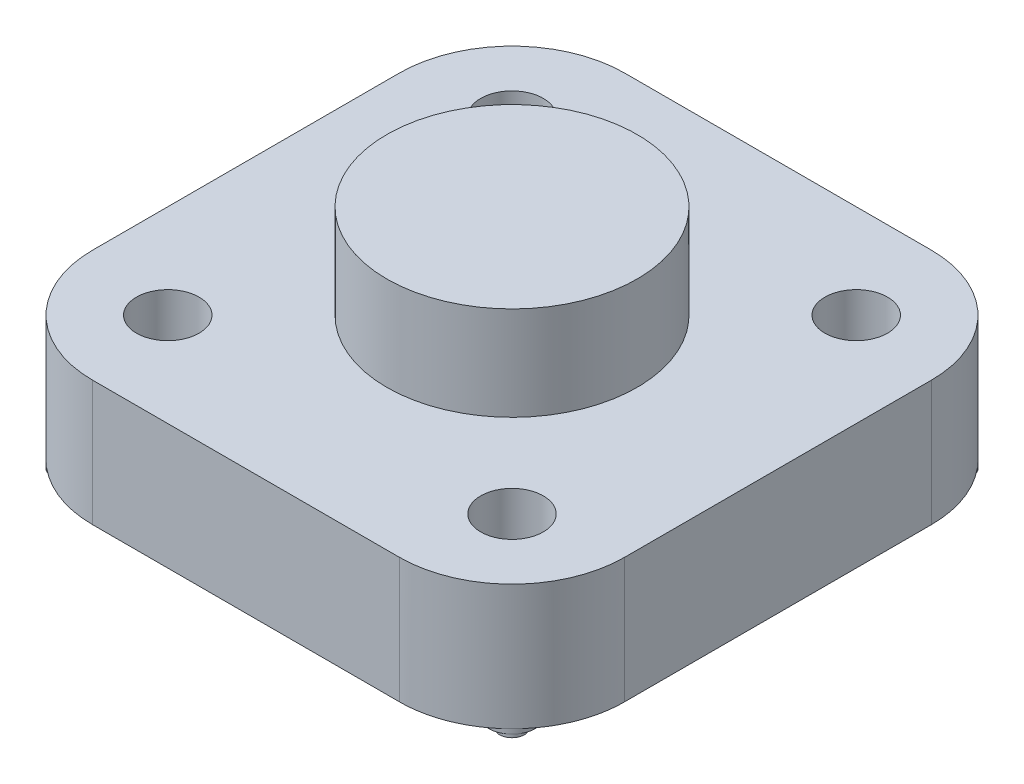
ISO-10303-21;
HEADER;
FILE_DESCRIPTION(('STEP AP214'),'2;1');
FILE_NAME('part.step','',(''),(''),'','','');
FILE_SCHEMA(('AUTOMOTIVE_DESIGN { 1 0 10303 214 1 1 1 1 }'));
ENDSEC;
DATA;
#1=APPLICATION_CONTEXT('core data for automotive mechanical design processes');
#2=APPLICATION_PROTOCOL_DEFINITION('international standard','automotive_design',2000,#1);
#3=PRODUCT_CONTEXT('',#1,'mechanical');
#4=PRODUCT('Part','Part','',(#3));
#5=PRODUCT_RELATED_PRODUCT_CATEGORY('part','',(#4));
#6=PRODUCT_DEFINITION_FORMATION('','',#4);
#7=PRODUCT_DEFINITION_CONTEXT('part definition',#1,'design');
#8=PRODUCT_DEFINITION('design','',#6,#7);
#9=PRODUCT_DEFINITION_SHAPE('','',#8);
#10=(LENGTH_UNIT() NAMED_UNIT(*) SI_UNIT(.MILLI.,.METRE.));
#11=(NAMED_UNIT(*) PLANE_ANGLE_UNIT() SI_UNIT($,.RADIAN.));
#12=(NAMED_UNIT(*) SI_UNIT($,.STERADIAN.) SOLID_ANGLE_UNIT());
#13=UNCERTAINTY_MEASURE_WITH_UNIT(LENGTH_MEASURE(1.E-05),#10,'distance_accuracy_value','');
#14=(GEOMETRIC_REPRESENTATION_CONTEXT(3) GLOBAL_UNCERTAINTY_ASSIGNED_CONTEXT((#13)) GLOBAL_UNIT_ASSIGNED_CONTEXT((#10,
#11,#12)) REPRESENTATION_CONTEXT('',''));
#15=CARTESIAN_POINT('',(0.,0.,0.));
#16=DIRECTION('',(0.,0.,1.));
#17=DIRECTION('',(1.,0.,0.));
#18=AXIS2_PLACEMENT_3D('',#15,#16,#17);
#19=CARTESIAN_POINT('',(490.,400.,-490.));
#20=DIRECTION('',(0.,-1.,0.));
#21=DIRECTION('',(0.,0.,-1.));
#22=AXIS2_PLACEMENT_3D('',#19,#20,#21);
#23=CYLINDRICAL_SURFACE('',#22,360.);
#24=CARTESIAN_POINT('',(490.,0.,-490.));
#25=DIRECTION('',(0.,1.,0.));
#26=DIRECTION('',(0.,0.,1.));
#27=AXIS2_PLACEMENT_3D('',#24,#25,#26);
#28=CIRCLE('',#27,360.);
#29=CARTESIAN_POINT('',(850.,0.,-489.999999999998));
#30=VERTEX_POINT('',#29);
#31=CARTESIAN_POINT('',(744.558441227227,0.,-744.558441227126));
#32=VERTEX_POINT('',#31);
#33=EDGE_CURVE('E139',#30,#32,#28,.T.);
#34=ORIENTED_EDGE('',*,*,#33,.T.);
#35=CARTESIAN_POINT('',(489.999999999997,0.,-850.));
#36=VERTEX_POINT('',#35);
#37=EDGE_CURVE('E143',#32,#36,#28,.T.);
#38=ORIENTED_EDGE('',*,*,#37,.T.);
#39=DIRECTION('',(0.,-1.,0.));
#40=VECTOR('',#39,1.);
#41=CARTESIAN_POINT('',(489.999999999997,400.,-850.));
#42=LINE('',#41,#40);
#43=CARTESIAN_POINT('',(489.999999999997,400.,-850.));
#44=VERTEX_POINT('',#43);
#45=EDGE_CURVE('E11',#44,#36,#42,.T.);
#46=ORIENTED_EDGE('',*,*,#45,.F.);
#47=CARTESIAN_POINT('',(490.,400.,-490.));
#48=DIRECTION('',(0.,1.,0.));
#49=DIRECTION('',(0.,0.,1.));
#50=AXIS2_PLACEMENT_3D('',#47,#48,#49);
#51=CIRCLE('',#50,360.);
#52=CARTESIAN_POINT('',(850.,400.,-489.999999999998));
#53=VERTEX_POINT('',#52);
#54=EDGE_CURVE('E159',#53,#44,#51,.T.);
#55=ORIENTED_EDGE('',*,*,#54,.F.);
#56=DIRECTION('',(0.,-1.,0.));
#57=VECTOR('',#56,1.);
#58=CARTESIAN_POINT('',(850.,400.,-489.999999999998));
#59=LINE('',#58,#57);
#60=EDGE_CURVE('E135',#53,#30,#59,.T.);
#61=ORIENTED_EDGE('',*,*,#60,.T.);
#62=EDGE_LOOP('',(#34,#38,#46,#55,#61));
#63=FACE_BOUND('',#62,.T.);
#64=ADVANCED_FACE('F35',(#63),#23,.T.);
#65=CARTESIAN_POINT('',(-489.999999999998,400.,-850.));
#66=DIRECTION('',(0.,0.,1.));
#67=DIRECTION('',(1.,0.,0.));
#68=AXIS2_PLACEMENT_3D('',#65,#66,#67);
#69=PLANE('',#68);
#70=DIRECTION('',(-1.,0.,0.));
#71=VECTOR('',#70,1.);
#72=CARTESIAN_POINT('',(-489.999999999998,0.,-850.));
#73=LINE('',#72,#71);
#74=CARTESIAN_POINT('',(-490.,0.,-850.));
#75=VERTEX_POINT('',#74);
#76=EDGE_CURVE('E142',#36,#75,#73,.T.);
#77=ORIENTED_EDGE('',*,*,#76,.T.);
#78=DIRECTION('',(0.,-1.,0.));
#79=VECTOR('',#78,1.);
#80=CARTESIAN_POINT('',(-490.,400.,-850.));
#81=LINE('',#80,#79);
#82=CARTESIAN_POINT('',(-490.,400.,-850.));
#83=VERTEX_POINT('',#82);
#84=EDGE_CURVE('E45',#83,#75,#81,.T.);
#85=ORIENTED_EDGE('',*,*,#84,.F.);
#86=DIRECTION('',(-1.,0.,0.));
#87=VECTOR('',#86,1.);
#88=CARTESIAN_POINT('',(-489.999999999998,400.,-850.));
#89=LINE('',#88,#87);
#90=EDGE_CURVE('E98',#44,#83,#89,.T.);
#91=ORIENTED_EDGE('',*,*,#90,.F.);
#92=ORIENTED_EDGE('',*,*,#45,.T.);
#93=EDGE_LOOP('',(#77,#85,#91,#92));
#94=FACE_BOUND('',#93,.T.);
#95=ADVANCED_FACE('F259',(#94),#69,.F.);
#96=CARTESIAN_POINT('',(-490.,400.,-490.));
#97=DIRECTION('',(0.,-1.,0.));
#98=DIRECTION('',(0.,0.,-1.));
#99=AXIS2_PLACEMENT_3D('',#96,#97,#98);
#100=CYLINDRICAL_SURFACE('',#99,360.);
#101=CARTESIAN_POINT('',(-490.,0.,-490.));
#102=DIRECTION('',(0.,1.,0.));
#103=DIRECTION('',(0.,0.,-1.));
#104=AXIS2_PLACEMENT_3D('',#101,#102,#103);
#105=CIRCLE('',#104,360.);
#106=CARTESIAN_POINT('',(-744.558441227131,0.,-744.558441227184));
#107=VERTEX_POINT('',#106);
#108=EDGE_CURVE('E146',#75,#107,#105,.T.);
#109=ORIENTED_EDGE('',*,*,#108,.T.);
#110=CARTESIAN_POINT('',(-850.,0.,-489.999999999998));
#111=VERTEX_POINT('',#110);
#112=EDGE_CURVE('E145',#107,#111,#105,.T.);
#113=ORIENTED_EDGE('',*,*,#112,.T.);
#114=DIRECTION('',(0.,-1.,0.));
#115=VECTOR('',#114,1.);
#116=CARTESIAN_POINT('',(-850.,400.,-489.999999999998));
#117=LINE('',#116,#115);
#118=CARTESIAN_POINT('',(-850.,400.,-489.999999999998));
#119=VERTEX_POINT('',#118);
#120=EDGE_CURVE('E166',#119,#111,#117,.T.);
#121=ORIENTED_EDGE('',*,*,#120,.F.);
#122=CARTESIAN_POINT('',(-490.,400.,-490.));
#123=DIRECTION('',(0.,1.,0.));
#124=DIRECTION('',(0.,0.,-1.));
#125=AXIS2_PLACEMENT_3D('',#122,#123,#124);
#126=CIRCLE('',#125,360.);
#127=EDGE_CURVE('E227',#83,#119,#126,.T.);
#128=ORIENTED_EDGE('',*,*,#127,.F.);
#129=ORIENTED_EDGE('',*,*,#84,.T.);
#130=EDGE_LOOP('',(#109,#113,#121,#128,#129));
#131=FACE_BOUND('',#130,.T.);
#132=ADVANCED_FACE('F261',(#131),#100,.T.);
#133=CARTESIAN_POINT('',(-850.,400.,-489.999999999998));
#134=DIRECTION('',(1.,0.,0.));
#135=DIRECTION('',(0.,0.,-1.));
#136=AXIS2_PLACEMENT_3D('',#133,#134,#135);
#137=PLANE('',#136);
#138=DIRECTION('',(0.,0.,1.));
#139=VECTOR('',#138,1.);
#140=CARTESIAN_POINT('',(-850.,0.,-489.999999999998));
#141=LINE('',#140,#139);
#142=CARTESIAN_POINT('',(-850.,0.,489.999999999998));
#143=VERTEX_POINT('',#142);
#144=EDGE_CURVE('E149',#111,#143,#141,.T.);
#145=ORIENTED_EDGE('',*,*,#144,.T.);
#146=DIRECTION('',(0.,-1.,0.));
#147=VECTOR('',#146,1.);
#148=CARTESIAN_POINT('',(-850.,400.,489.999999999998));
#149=LINE('',#148,#147);
#150=CARTESIAN_POINT('',(-850.,400.,489.999999999998));
#151=VERTEX_POINT('',#150);
#152=EDGE_CURVE('E163',#151,#143,#149,.T.);
#153=ORIENTED_EDGE('',*,*,#152,.F.);
#154=DIRECTION('',(0.,0.,1.));
#155=VECTOR('',#154,1.);
#156=CARTESIAN_POINT('',(-850.,400.,-489.999999999998));
#157=LINE('',#156,#155);
#158=EDGE_CURVE('E229',#119,#151,#157,.T.);
#159=ORIENTED_EDGE('',*,*,#158,.F.);
#160=ORIENTED_EDGE('',*,*,#120,.T.);
#161=EDGE_LOOP('',(#145,#153,#159,#160));
#162=FACE_BOUND('',#161,.T.);
#163=ADVANCED_FACE('F235',(#162),#137,.F.);
#164=CARTESIAN_POINT('',(-490.,400.,490.));
#165=DIRECTION('',(0.,-1.,0.));
#166=DIRECTION('',(0.,0.,-1.));
#167=AXIS2_PLACEMENT_3D('',#164,#165,#166);
#168=CYLINDRICAL_SURFACE('',#167,360.);
#169=CARTESIAN_POINT('',(-490.,0.,490.));
#170=DIRECTION('',(0.,1.,0.));
#171=DIRECTION('',(0.,0.,-1.));
#172=AXIS2_PLACEMENT_3D('',#169,#170,#171);
#173=CIRCLE('',#172,360.);
#174=CARTESIAN_POINT('',(-744.558441227178,0.,744.558441227174));
#175=VERTEX_POINT('',#174);
#176=EDGE_CURVE('E152',#143,#175,#173,.T.);
#177=ORIENTED_EDGE('',*,*,#176,.T.);
#178=CARTESIAN_POINT('',(-489.999999999998,0.,850.));
#179=VERTEX_POINT('',#178);
#180=EDGE_CURVE('E151',#175,#179,#173,.T.);
#181=ORIENTED_EDGE('',*,*,#180,.T.);
#182=DIRECTION('',(0.,-1.,0.));
#183=VECTOR('',#182,1.);
#184=CARTESIAN_POINT('',(-489.999999999998,400.,850.));
#185=LINE('',#184,#183);
#186=CARTESIAN_POINT('',(-489.999999999998,400.,850.));
#187=VERTEX_POINT('',#186);
#188=EDGE_CURVE('E130',#187,#179,#185,.T.);
#189=ORIENTED_EDGE('',*,*,#188,.F.);
#190=CARTESIAN_POINT('',(-490.,400.,490.));
#191=DIRECTION('',(0.,1.,0.));
#192=DIRECTION('',(0.,0.,-1.));
#193=AXIS2_PLACEMENT_3D('',#190,#191,#192);
#194=CIRCLE('',#193,360.);
#195=EDGE_CURVE('E119',#151,#187,#194,.T.);
#196=ORIENTED_EDGE('',*,*,#195,.F.);
#197=ORIENTED_EDGE('',*,*,#152,.T.);
#198=EDGE_LOOP('',(#177,#181,#189,#196,#197));
#199=FACE_BOUND('',#198,.T.);
#200=ADVANCED_FACE('F239',(#199),#168,.T.);
#201=CARTESIAN_POINT('',(-489.999999999998,400.,850.));
#202=DIRECTION('',(0.,0.,-1.));
#203=DIRECTION('',(-1.,0.,0.));
#204=AXIS2_PLACEMENT_3D('',#201,#202,#203);
#205=PLANE('',#204);
#206=DIRECTION('',(1.,0.,0.));
#207=VECTOR('',#206,1.);
#208=CARTESIAN_POINT('',(-489.999999999998,0.,850.));
#209=LINE('',#208,#207);
#210=CARTESIAN_POINT('',(489.999999999998,0.,850.));
#211=VERTEX_POINT('',#210);
#212=EDGE_CURVE('E128',#179,#211,#209,.T.);
#213=ORIENTED_EDGE('',*,*,#212,.T.);
#214=DIRECTION('',(0.,-1.,0.));
#215=VECTOR('',#214,1.);
#216=CARTESIAN_POINT('',(489.999999999998,400.,850.));
#217=LINE('',#216,#215);
#218=CARTESIAN_POINT('',(489.999999999998,400.,850.));
#219=VERTEX_POINT('',#218);
#220=EDGE_CURVE('E125',#219,#211,#217,.T.);
#221=ORIENTED_EDGE('',*,*,#220,.F.);
#222=DIRECTION('',(1.,0.,0.));
#223=VECTOR('',#222,1.);
#224=CARTESIAN_POINT('',(-489.999999999998,400.,850.));
#225=LINE('',#224,#223);
#226=EDGE_CURVE('E113',#187,#219,#225,.T.);
#227=ORIENTED_EDGE('',*,*,#226,.F.);
#228=ORIENTED_EDGE('',*,*,#188,.T.);
#229=EDGE_LOOP('',(#213,#221,#227,#228));
#230=FACE_BOUND('',#229,.T.);
#231=ADVANCED_FACE('F126',(#230),#205,.F.);
#232=CARTESIAN_POINT('',(490.,400.,490.));
#233=DIRECTION('',(0.,-1.,0.));
#234=DIRECTION('',(0.,0.,-1.));
#235=AXIS2_PLACEMENT_3D('',#232,#233,#234);
#236=CYLINDRICAL_SURFACE('',#235,360.);
#237=CARTESIAN_POINT('',(490.,0.,490.));
#238=DIRECTION('',(0.,1.,0.));
#239=DIRECTION('',(0.,0.,-1.));
#240=AXIS2_PLACEMENT_3D('',#237,#238,#239);
#241=CIRCLE('',#240,360.);
#242=CARTESIAN_POINT('',(744.558441227169,0.,744.558441227222));
#243=VERTEX_POINT('',#242);
#244=EDGE_CURVE('E156',#211,#243,#241,.T.);
#245=ORIENTED_EDGE('',*,*,#244,.T.);
#246=CARTESIAN_POINT('',(850.,0.,489.999999999998));
#247=VERTEX_POINT('',#246);
#248=EDGE_CURVE('E84',#243,#247,#241,.T.);
#249=ORIENTED_EDGE('',*,*,#248,.T.);
#250=DIRECTION('',(0.,-1.,0.));
#251=VECTOR('',#250,1.);
#252=CARTESIAN_POINT('',(850.,400.,489.999999999998));
#253=LINE('',#252,#251);
#254=CARTESIAN_POINT('',(850.,400.,489.999999999998));
#255=VERTEX_POINT('',#254);
#256=EDGE_CURVE('E131',#255,#247,#253,.T.);
#257=ORIENTED_EDGE('',*,*,#256,.F.);
#258=CARTESIAN_POINT('',(490.,400.,490.));
#259=DIRECTION('',(0.,1.,0.));
#260=DIRECTION('',(0.,0.,-1.));
#261=AXIS2_PLACEMENT_3D('',#258,#259,#260);
#262=CIRCLE('',#261,360.);
#263=EDGE_CURVE('E117',#219,#255,#262,.T.);
#264=ORIENTED_EDGE('',*,*,#263,.F.);
#265=ORIENTED_EDGE('',*,*,#220,.T.);
#266=EDGE_LOOP('',(#245,#249,#257,#264,#265));
#267=FACE_BOUND('',#266,.T.);
#268=ADVANCED_FACE('F133',(#267),#236,.T.);
#269=CARTESIAN_POINT('',(850.,400.,-489.999999999998));
#270=DIRECTION('',(-1.,0.,0.));
#271=DIRECTION('',(0.,0.,1.));
#272=AXIS2_PLACEMENT_3D('',#269,#270,#271);
#273=PLANE('',#272);
#274=DIRECTION('',(0.,0.,-1.));
#275=VECTOR('',#274,1.);
#276=CARTESIAN_POINT('',(850.,0.,-489.999999999998));
#277=LINE('',#276,#275);
#278=EDGE_CURVE('E90',#247,#30,#277,.T.);
#279=ORIENTED_EDGE('',*,*,#278,.T.);
#280=ORIENTED_EDGE('',*,*,#60,.F.);
#281=DIRECTION('',(0.,0.,-1.));
#282=VECTOR('',#281,1.);
#283=CARTESIAN_POINT('',(850.,400.,-489.999999999998));
#284=LINE('',#283,#282);
#285=EDGE_CURVE('E54',#255,#53,#284,.T.);
#286=ORIENTED_EDGE('',*,*,#285,.F.);
#287=ORIENTED_EDGE('',*,*,#256,.T.);
#288=EDGE_LOOP('',(#279,#280,#286,#287));
#289=FACE_BOUND('',#288,.T.);
#290=ADVANCED_FACE('F475',(#289),#273,.F.);
#291=CARTESIAN_POINT('',(490.,400.,-490.));
#292=DIRECTION('',(0.,1.,0.));
#293=DIRECTION('',(0.,0.,1.));
#294=AXIS2_PLACEMENT_3D('',#291,#292,#293);
#295=PLANE('',#294);
#296=CARTESIAN_POINT('',(550.,400.,-550.));
#297=DIRECTION('',(0.,1.,0.));
#298=DIRECTION('',(0.,0.,1.));
#299=AXIS2_PLACEMENT_3D('',#296,#297,#298);
#300=CIRCLE('',#299,100.);
#301=CARTESIAN_POINT('',(550.,400.,-450.));
#302=VERTEX_POINT('',#301);
#303=EDGE_CURVE('E645',#302,#302,#300,.T.);
#304=ORIENTED_EDGE('',*,*,#303,.F.);
#305=EDGE_LOOP('',(#304));
#306=FACE_BOUND('',#305,.T.);
#307=CARTESIAN_POINT('',(-550.,400.,550.));
#308=DIRECTION('',(0.,1.,0.));
#309=DIRECTION('',(0.,0.,1.));
#310=AXIS2_PLACEMENT_3D('',#307,#308,#309);
#311=CIRCLE('',#310,100.);
#312=CARTESIAN_POINT('',(-550.,400.,650.));
#313=VERTEX_POINT('',#312);
#314=EDGE_CURVE('E639',#313,#313,#311,.T.);
#315=ORIENTED_EDGE('',*,*,#314,.F.);
#316=EDGE_LOOP('',(#315));
#317=FACE_BOUND('',#316,.T.);
#318=CARTESIAN_POINT('',(550.,400.,550.));
#319=DIRECTION('',(0.,1.,0.));
#320=DIRECTION('',(0.,0.,1.));
#321=AXIS2_PLACEMENT_3D('',#318,#319,#320);
#322=CIRCLE('',#321,100.);
#323=CARTESIAN_POINT('',(550.,400.,650.));
#324=VERTEX_POINT('',#323);
#325=EDGE_CURVE('E633',#324,#324,#322,.T.);
#326=ORIENTED_EDGE('',*,*,#325,.F.);
#327=EDGE_LOOP('',(#326));
#328=FACE_BOUND('',#327,.T.);
#329=CARTESIAN_POINT('',(-550.,400.,-550.));
#330=DIRECTION('',(0.,1.,0.));
#331=DIRECTION('',(0.,0.,1.));
#332=AXIS2_PLACEMENT_3D('',#329,#330,#331);
#333=CIRCLE('',#332,100.);
#334=CARTESIAN_POINT('',(-550.,400.,-450.));
#335=VERTEX_POINT('',#334);
#336=EDGE_CURVE('E627',#335,#335,#333,.T.);
#337=ORIENTED_EDGE('',*,*,#336,.F.);
#338=EDGE_LOOP('',(#337));
#339=FACE_BOUND('',#338,.T.);
#340=CARTESIAN_POINT('',(0.,400.,0.));
#341=DIRECTION('',(0.,1.,0.));
#342=DIRECTION('',(0.,0.,1.));
#343=AXIS2_PLACEMENT_3D('',#340,#341,#342);
#344=CIRCLE('',#343,400.);
#345=CARTESIAN_POINT('',(0.,400.,400.));
#346=VERTEX_POINT('',#345);
#347=EDGE_CURVE('E188',#346,#346,#344,.T.);
#348=ORIENTED_EDGE('',*,*,#347,.F.);
#349=EDGE_LOOP('',(#348));
#350=FACE_BOUND('',#349,.T.);
#351=ORIENTED_EDGE('',*,*,#54,.T.);
#352=ORIENTED_EDGE('',*,*,#90,.T.);
#353=ORIENTED_EDGE('',*,*,#127,.T.);
#354=ORIENTED_EDGE('',*,*,#158,.T.);
#355=ORIENTED_EDGE('',*,*,#195,.T.);
#356=ORIENTED_EDGE('',*,*,#226,.T.);
#357=ORIENTED_EDGE('',*,*,#263,.T.);
#358=ORIENTED_EDGE('',*,*,#285,.T.);
#359=EDGE_LOOP('',(#351,#352,#353,#354,#355,#356,#357,#358));
#360=FACE_BOUND('',#359,.T.);
#361=ADVANCED_FACE('F115',(#306,#317,#328,#339,#350,#360),#295,.T.);
#362=CARTESIAN_POINT('',(490.,0.,-490.));
#363=DIRECTION('',(0.,1.,0.));
#364=DIRECTION('',(0.,0.,1.));
#365=AXIS2_PLACEMENT_3D('',#362,#363,#364);
#366=PLANE('',#365);
#367=ORIENTED_EDGE('',*,*,#112,.F.);
#368=CARTESIAN_POINT('',(-691.525432638145,0.,-691.525432638187));
#369=DIRECTION('',(0.,-1.,0.));
#370=DIRECTION('',(0.,0.,-1.));
#371=AXIS2_PLACEMENT_3D('',#368,#369,#370);
#372=CIRCLE('',#371,74.9999999999999);
#373=EDGE_CURVE('E174',#107,#107,#372,.T.);
#374=ORIENTED_EDGE('',*,*,#373,.F.);
#375=ORIENTED_EDGE('',*,*,#108,.F.);
#376=ORIENTED_EDGE('',*,*,#76,.F.);
#377=ORIENTED_EDGE('',*,*,#37,.F.);
#378=CARTESIAN_POINT('',(691.525432638225,0.,-691.525432638145));
#379=DIRECTION('',(0.,-1.,0.));
#380=DIRECTION('',(0.,0.,-1.));
#381=AXIS2_PLACEMENT_3D('',#378,#379,#380);
#382=CIRCLE('',#381,75.);
#383=EDGE_CURVE('E205',#32,#32,#382,.T.);
#384=ORIENTED_EDGE('',*,*,#383,.F.);
#385=ORIENTED_EDGE('',*,*,#33,.F.);
#386=ORIENTED_EDGE('',*,*,#278,.F.);
#387=ORIENTED_EDGE('',*,*,#248,.F.);
#388=CARTESIAN_POINT('',(691.525432638183,0.,691.525432638225));
#389=DIRECTION('',(0.,-1.,0.));
#390=DIRECTION('',(0.,0.,-1.));
#391=AXIS2_PLACEMENT_3D('',#388,#389,#390);
#392=CIRCLE('',#391,75.);
#393=EDGE_CURVE('E211',#243,#243,#392,.T.);
#394=ORIENTED_EDGE('',*,*,#393,.F.);
#395=ORIENTED_EDGE('',*,*,#244,.F.);
#396=ORIENTED_EDGE('',*,*,#212,.F.);
#397=ORIENTED_EDGE('',*,*,#180,.F.);
#398=CARTESIAN_POINT('',(-691.525432638187,0.,691.525432638183));
#399=DIRECTION('',(0.,-1.,0.));
#400=DIRECTION('',(0.,0.,-1.));
#401=AXIS2_PLACEMENT_3D('',#398,#399,#400);
#402=CIRCLE('',#401,75.);
#403=EDGE_CURVE('E217',#175,#175,#402,.T.);
#404=ORIENTED_EDGE('',*,*,#403,.F.);
#405=ORIENTED_EDGE('',*,*,#176,.F.);
#406=ORIENTED_EDGE('',*,*,#144,.F.);
#407=EDGE_LOOP('',(#367,#374,#375,#376,#377,#384,#385,#386,#387,#394,#395,#396,#397,#404,#405,#406));
#408=FACE_BOUND('',#407,.T.);
#409=ADVANCED_FACE('F243',(#408),#366,.F.);
#410=CARTESIAN_POINT('',(-691.525432638187,-15.,691.525432638183));
#411=DIRECTION('',(0.,1.,0.));
#412=DIRECTION('',(0.,0.,1.));
#413=AXIS2_PLACEMENT_3D('',#410,#411,#412);
#414=CYLINDRICAL_SURFACE('',#413,75.);
#415=CARTESIAN_POINT('',(-691.525432638187,-15.,691.525432638183));
#416=DIRECTION('',(0.,-1.,0.));
#417=DIRECTION('',(0.,0.,-1.));
#418=AXIS2_PLACEMENT_3D('',#415,#416,#417);
#419=CIRCLE('',#418,75.);
#420=CARTESIAN_POINT('',(-744.558441227276,-15.,744.558441227093));
#421=VERTEX_POINT('',#420);
#422=EDGE_CURVE('E220',#421,#421,#419,.T.);
#423=ORIENTED_EDGE('',*,*,#422,.F.);
#424=EDGE_LOOP('',(#423));
#425=FACE_BOUND('',#424,.T.);
#426=ORIENTED_EDGE('',*,*,#403,.T.);
#427=EDGE_LOOP('',(#426));
#428=FACE_BOUND('',#427,.T.);
#429=ADVANCED_FACE('F263',(#425,#428),#414,.T.);
#430=CARTESIAN_POINT('',(-691.525432638187,-15.,691.525432638183));
#431=DIRECTION('',(0.,-1.,0.));
#432=DIRECTION('',(0.,0.,-1.));
#433=AXIS2_PLACEMENT_3D('',#430,#431,#432);
#434=PLANE('',#433);
#435=ORIENTED_EDGE('',*,*,#422,.T.);
#436=CARTESIAN_POINT('',(-716.274169979736,-15.,716.274169979648));
#437=DIRECTION('',(0.,-1.,0.));
#438=DIRECTION('',(0.,0.,-1.));
#439=AXIS2_PLACEMENT_3D('',#436,#437,#438);
#440=CIRCLE('',#439,40.0000000000432);
#441=EDGE_CURVE('E182',#421,#421,#440,.T.);
#442=ORIENTED_EDGE('',*,*,#441,.F.);
#443=EDGE_LOOP('',(#435,#442));
#444=FACE_BOUND('',#443,.T.);
#445=ADVANCED_FACE('F265',(#444),#434,.T.);
#446=CARTESIAN_POINT('',(691.525432638183,-15.,691.525432638225));
#447=DIRECTION('',(0.,1.,0.));
#448=DIRECTION('',(0.,0.,1.));
#449=AXIS2_PLACEMENT_3D('',#446,#447,#448);
#450=CYLINDRICAL_SURFACE('',#449,75.);
#451=CARTESIAN_POINT('',(691.525432638183,-15.,691.525432638225));
#452=DIRECTION('',(0.,-1.,0.));
#453=DIRECTION('',(0.,0.,-1.));
#454=AXIS2_PLACEMENT_3D('',#451,#452,#453);
#455=CIRCLE('',#454,75.);
#456=CARTESIAN_POINT('',(744.558441227148,-15.,744.5584412272));
#457=VERTEX_POINT('',#456);
#458=EDGE_CURVE('E214',#457,#457,#455,.T.);
#459=ORIENTED_EDGE('',*,*,#458,.F.);
#460=EDGE_LOOP('',(#459));
#461=FACE_BOUND('',#460,.T.);
#462=ORIENTED_EDGE('',*,*,#393,.T.);
#463=EDGE_LOOP('',(#462));
#464=FACE_BOUND('',#463,.T.);
#465=ADVANCED_FACE('F272',(#461,#464),#450,.T.);
#466=CARTESIAN_POINT('',(691.525432638183,-15.,691.525432638225));
#467=DIRECTION('',(0.,-1.,0.));
#468=DIRECTION('',(0.,0.,-1.));
#469=AXIS2_PLACEMENT_3D('',#466,#467,#468);
#470=PLANE('',#469);
#471=ORIENTED_EDGE('',*,*,#458,.T.);
#472=CARTESIAN_POINT('',(716.274169979689,-15.,716.274169979735));
#473=DIRECTION('',(0.,-1.,0.));
#474=DIRECTION('',(0.,0.,-1.));
#475=AXIS2_PLACEMENT_3D('',#472,#473,#474);
#476=CIRCLE('',#475,40.);
#477=EDGE_CURVE('E175',#457,#457,#476,.T.);
#478=ORIENTED_EDGE('',*,*,#477,.F.);
#479=EDGE_LOOP('',(#471,#478));
#480=FACE_BOUND('',#479,.T.);
#481=ADVANCED_FACE('F339',(#480),#470,.T.);
#482=CARTESIAN_POINT('',(691.525432638225,-15.,-691.525432638145));
#483=DIRECTION('',(0.,1.,0.));
#484=DIRECTION('',(0.,0.,1.));
#485=AXIS2_PLACEMENT_3D('',#482,#483,#484);
#486=CYLINDRICAL_SURFACE('',#485,75.);
#487=CARTESIAN_POINT('',(691.525432638225,-15.,-691.525432638145));
#488=DIRECTION('',(0.,-1.,0.));
#489=DIRECTION('',(0.,0.,-1.));
#490=AXIS2_PLACEMENT_3D('',#487,#488,#489);
#491=CIRCLE('',#490,75.);
#492=CARTESIAN_POINT('',(744.558441227234,-15.,-744.558441227139));
#493=VERTEX_POINT('',#492);
#494=EDGE_CURVE('E208',#493,#493,#491,.T.);
#495=ORIENTED_EDGE('',*,*,#494,.F.);
#496=EDGE_LOOP('',(#495));
#497=FACE_BOUND('',#496,.T.);
#498=ORIENTED_EDGE('',*,*,#383,.T.);
#499=EDGE_LOOP('',(#498));
#500=FACE_BOUND('',#499,.T.);
#501=ADVANCED_FACE('F335',(#497,#500),#486,.T.);
#502=CARTESIAN_POINT('',(691.525432638225,-15.,-691.525432638145));
#503=DIRECTION('',(0.,-1.,0.));
#504=DIRECTION('',(0.,0.,-1.));
#505=AXIS2_PLACEMENT_3D('',#502,#503,#504);
#506=PLANE('',#505);
#507=ORIENTED_EDGE('',*,*,#494,.T.);
#508=CARTESIAN_POINT('',(716.274169979776,-15.,-716.274169979689));
#509=DIRECTION('',(0.,-1.,0.));
#510=DIRECTION('',(0.,0.,-1.));
#511=AXIS2_PLACEMENT_3D('',#508,#509,#510);
#512=CIRCLE('',#511,39.99999999999);
#513=EDGE_CURVE('E178',#493,#493,#512,.T.);
#514=ORIENTED_EDGE('',*,*,#513,.F.);
#515=EDGE_LOOP('',(#507,#514));
#516=FACE_BOUND('',#515,.T.);
#517=ADVANCED_FACE('F331',(#516),#506,.T.);
#518=CARTESIAN_POINT('',(-691.525432638145,-15.,-691.525432638187));
#519=DIRECTION('',(0.,1.,0.));
#520=DIRECTION('',(0.,0.,1.));
#521=AXIS2_PLACEMENT_3D('',#518,#519,#520);
#522=CYLINDRICAL_SURFACE('',#521,74.9999999999999);
#523=CARTESIAN_POINT('',(-691.525432638145,-15.,-691.525432638187));
#524=DIRECTION('',(0.,-1.,0.));
#525=DIRECTION('',(0.,0.,-1.));
#526=AXIS2_PLACEMENT_3D('',#523,#524,#525);
#527=CIRCLE('',#526,74.9999999999999);
#528=CARTESIAN_POINT('',(-744.558441227083,-15.,-744.558441227307));
#529=VERTEX_POINT('',#528);
#530=EDGE_CURVE('E202',#529,#529,#527,.T.);
#531=ORIENTED_EDGE('',*,*,#530,.F.);
#532=EDGE_LOOP('',(#531));
#533=FACE_BOUND('',#532,.T.);
#534=ORIENTED_EDGE('',*,*,#373,.T.);
#535=EDGE_LOOP('',(#534));
#536=FACE_BOUND('',#535,.T.);
#537=ADVANCED_FACE('F327',(#533,#536),#522,.T.);
#538=CARTESIAN_POINT('',(-691.525432638145,-15.,-691.525432638187));
#539=DIRECTION('',(0.,-1.,0.));
#540=DIRECTION('',(0.,0.,-1.));
#541=AXIS2_PLACEMENT_3D('',#538,#539,#540);
#542=PLANE('',#541);
#543=ORIENTED_EDGE('',*,*,#530,.T.);
#544=CARTESIAN_POINT('',(-716.274169979648,-15.,-716.274169979776));
#545=DIRECTION('',(0.,-1.,0.));
#546=DIRECTION('',(0.,0.,-1.));
#547=AXIS2_PLACEMENT_3D('',#544,#545,#546);
#548=CIRCLE('',#547,40.0000000000296);
#549=EDGE_CURVE('E181',#529,#529,#548,.T.);
#550=ORIENTED_EDGE('',*,*,#549,.F.);
#551=EDGE_LOOP('',(#543,#550));
#552=FACE_BOUND('',#551,.T.);
#553=ADVANCED_FACE('F323',(#552),#542,.T.);
#554=CARTESIAN_POINT('',(716.274169979689,-25.,716.274169979735));
#555=DIRECTION('',(0.,1.,0.));
#556=DIRECTION('',(0.,0.,1.));
#557=AXIS2_PLACEMENT_3D('',#554,#555,#556);
#558=CYLINDRICAL_SURFACE('',#557,40.);
#559=CARTESIAN_POINT('',(716.274169979689,-25.,716.274169979735));
#560=DIRECTION('',(0.,-1.,0.));
#561=DIRECTION('',(0.,0.,-1.));
#562=AXIS2_PLACEMENT_3D('',#559,#560,#561);
#563=CIRCLE('',#562,40.);
#564=CARTESIAN_POINT('',(716.274169979689,-25.,676.274169979735));
#565=VERTEX_POINT('',#564);
#566=EDGE_CURVE('E171',#565,#565,#563,.T.);
#567=ORIENTED_EDGE('',*,*,#566,.F.);
#568=EDGE_LOOP('',(#567));
#569=FACE_BOUND('',#568,.T.);
#570=ORIENTED_EDGE('',*,*,#477,.T.);
#571=EDGE_LOOP('',(#570));
#572=FACE_BOUND('',#571,.T.);
#573=ADVANCED_FACE('F290',(#569,#572),#558,.T.);
#574=CARTESIAN_POINT('',(716.274169979689,50.0000000000002,716.274169979735));
#575=DIRECTION('',(0.,0.,1.));
#576=DIRECTION('',(1.,0.,0.));
#577=AXIS2_PLACEMENT_3D('',#574,#575,#576);
#578=SPHERICAL_SURFACE('',#577,85.0000000000002);
#579=CARTESIAN_POINT('',(716.274169979689,50.0000000000002,716.274169979735));
#580=DIRECTION('',(0.,-1.,0.));
#581=DIRECTION('',(0.,0.,-1.));
#582=AXIS2_PLACEMENT_3D('',#579,#580,#581);
#583=SPHERICAL_SURFACE('',#582,85.0000000000002);
#584=ORIENTED_EDGE('',*,*,#566,.T.);
#585=EDGE_LOOP('',(#584));
#586=FACE_BOUND('',#585,.T.);
#587=ADVANCED_FACE('F286',(#586),#583,.T.);
#588=CARTESIAN_POINT('',(716.274169979776,-25.,-716.274169979689));
#589=DIRECTION('',(0.,1.,0.));
#590=DIRECTION('',(0.,0.,1.));
#591=AXIS2_PLACEMENT_3D('',#588,#589,#590);
#592=CYLINDRICAL_SURFACE('',#591,39.99999999999);
#593=CARTESIAN_POINT('',(716.274169979776,-25.,-716.274169979689));
#594=DIRECTION('',(0.,-1.,0.));
#595=DIRECTION('',(0.,0.,-1.));
#596=AXIS2_PLACEMENT_3D('',#593,#594,#595);
#597=CIRCLE('',#596,39.99999999999);
#598=CARTESIAN_POINT('',(716.274169979776,-25.,-756.274169979679));
#599=VERTEX_POINT('',#598);
#600=EDGE_CURVE('E176',#599,#599,#597,.T.);
#601=ORIENTED_EDGE('',*,*,#600,.F.);
#602=EDGE_LOOP('',(#601));
#603=FACE_BOUND('',#602,.T.);
#604=ORIENTED_EDGE('',*,*,#513,.T.);
#605=EDGE_LOOP('',(#604));
#606=FACE_BOUND('',#605,.T.);
#607=ADVANCED_FACE('F289',(#603,#606),#592,.T.);
#608=CARTESIAN_POINT('',(716.274169979776,49.9999999999599,-716.274169979689));
#609=DIRECTION('',(0.,0.,1.));
#610=DIRECTION('',(1.,0.,0.));
#611=AXIS2_PLACEMENT_3D('',#608,#609,#610);
#612=SPHERICAL_SURFACE('',#611,84.9999999999599);
#613=CARTESIAN_POINT('',(716.274169979776,49.9999999999599,-716.274169979689));
#614=DIRECTION('',(0.,-1.,0.));
#615=DIRECTION('',(0.,0.,-1.));
#616=AXIS2_PLACEMENT_3D('',#613,#614,#615);
#617=SPHERICAL_SURFACE('',#616,84.9999999999599);
#618=ORIENTED_EDGE('',*,*,#600,.T.);
#619=EDGE_LOOP('',(#618));
#620=FACE_BOUND('',#619,.T.);
#621=ADVANCED_FACE('F292',(#620),#617,.T.);
#622=CARTESIAN_POINT('',(-716.274169979648,-25.,-716.274169979776));
#623=DIRECTION('',(0.,1.,0.));
#624=DIRECTION('',(0.,0.,1.));
#625=AXIS2_PLACEMENT_3D('',#622,#623,#624);
#626=CYLINDRICAL_SURFACE('',#625,40.0000000000296);
#627=CARTESIAN_POINT('',(-716.274169979648,-25.,-716.274169979776));
#628=DIRECTION('',(0.,-1.,0.));
#629=DIRECTION('',(0.,0.,-1.));
#630=AXIS2_PLACEMENT_3D('',#627,#628,#629);
#631=CIRCLE('',#630,40.0000000000296);
#632=CARTESIAN_POINT('',(-716.274169979648,-25.,-756.274169979805));
#633=VERTEX_POINT('',#632);
#634=EDGE_CURVE('E39',#633,#633,#631,.T.);
#635=ORIENTED_EDGE('',*,*,#634,.F.);
#636=EDGE_LOOP('',(#635));
#637=FACE_BOUND('',#636,.T.);
#638=ORIENTED_EDGE('',*,*,#549,.T.);
#639=EDGE_LOOP('',(#638));
#640=FACE_BOUND('',#639,.T.);
#641=ADVANCED_FACE('F294',(#637,#640),#626,.T.);
#642=CARTESIAN_POINT('',(-716.274169979648,50.0000000001183,-716.274169979776));
#643=DIRECTION('',(0.,0.,1.));
#644=DIRECTION('',(1.,0.,0.));
#645=AXIS2_PLACEMENT_3D('',#642,#643,#644);
#646=SPHERICAL_SURFACE('',#645,85.0000000001183);
#647=CARTESIAN_POINT('',(-716.274169979648,50.0000000001183,-716.274169979776));
#648=DIRECTION('',(0.,-1.,0.));
#649=DIRECTION('',(0.,0.,-1.));
#650=AXIS2_PLACEMENT_3D('',#647,#648,#649);
#651=SPHERICAL_SURFACE('',#650,85.0000000001183);
#652=ORIENTED_EDGE('',*,*,#634,.T.);
#653=EDGE_LOOP('',(#652));
#654=FACE_BOUND('',#653,.T.);
#655=ADVANCED_FACE('F37',(#654),#651,.T.);
#656=CARTESIAN_POINT('',(-716.274169979736,-25.,716.274169979648));
#657=DIRECTION('',(0.,1.,0.));
#658=DIRECTION('',(0.,0.,1.));
#659=AXIS2_PLACEMENT_3D('',#656,#657,#658);
#660=CYLINDRICAL_SURFACE('',#659,40.0000000000432);
#661=CARTESIAN_POINT('',(-716.274169979736,-25.,716.274169979648));
#662=DIRECTION('',(0.,-1.,0.));
#663=DIRECTION('',(0.,0.,-1.));
#664=AXIS2_PLACEMENT_3D('',#661,#662,#663);
#665=CIRCLE('',#664,40.0000000000432);
#666=CARTESIAN_POINT('',(-716.274169979736,-25.,676.274169979605));
#667=VERTEX_POINT('',#666);
#668=EDGE_CURVE('E179',#667,#667,#665,.T.);
#669=ORIENTED_EDGE('',*,*,#668,.F.);
#670=EDGE_LOOP('',(#669));
#671=FACE_BOUND('',#670,.T.);
#672=ORIENTED_EDGE('',*,*,#441,.T.);
#673=EDGE_LOOP('',(#672));
#674=FACE_BOUND('',#673,.T.);
#675=ADVANCED_FACE('F299',(#671,#674),#660,.T.);
#676=CARTESIAN_POINT('',(-716.274169979736,50.0000000001727,716.274169979648));
#677=DIRECTION('',(0.,0.,1.));
#678=DIRECTION('',(1.,0.,0.));
#679=AXIS2_PLACEMENT_3D('',#676,#677,#678);
#680=SPHERICAL_SURFACE('',#679,85.0000000001727);
#681=CARTESIAN_POINT('',(-716.274169979736,50.0000000001727,716.274169979648));
#682=DIRECTION('',(0.,-1.,0.));
#683=DIRECTION('',(0.,0.,-1.));
#684=AXIS2_PLACEMENT_3D('',#681,#682,#683);
#685=SPHERICAL_SURFACE('',#684,85.0000000001727);
#686=ORIENTED_EDGE('',*,*,#668,.T.);
#687=EDGE_LOOP('',(#686));
#688=FACE_BOUND('',#687,.T.);
#689=ADVANCED_FACE('F296',(#688),#685,.T.);
#690=CARTESIAN_POINT('',(0.,700.,0.));
#691=DIRECTION('',(0.,-1.,0.));
#692=DIRECTION('',(0.,0.,-1.));
#693=AXIS2_PLACEMENT_3D('',#690,#691,#692);
#694=CYLINDRICAL_SURFACE('',#693,400.);
#695=ORIENTED_EDGE('',*,*,#347,.T.);
#696=EDGE_LOOP('',(#695));
#697=FACE_BOUND('',#696,.T.);
#698=CARTESIAN_POINT('',(0.,700.,0.));
#699=DIRECTION('',(0.,1.,0.));
#700=DIRECTION('',(0.,0.,1.));
#701=AXIS2_PLACEMENT_3D('',#698,#699,#700);
#702=CIRCLE('',#701,400.);
#703=CARTESIAN_POINT('',(0.,700.,400.));
#704=VERTEX_POINT('',#703);
#705=EDGE_CURVE('E194',#704,#704,#702,.T.);
#706=ORIENTED_EDGE('',*,*,#705,.F.);
#707=EDGE_LOOP('',(#706));
#708=FACE_BOUND('',#707,.T.);
#709=ADVANCED_FACE('F298',(#697,#708),#694,.T.);
#710=CARTESIAN_POINT('',(0.,700.,0.));
#711=DIRECTION('',(0.,1.,0.));
#712=DIRECTION('',(0.,0.,1.));
#713=AXIS2_PLACEMENT_3D('',#710,#711,#712);
#714=PLANE('',#713);
#715=ORIENTED_EDGE('',*,*,#705,.T.);
#716=EDGE_LOOP('',(#715));
#717=FACE_BOUND('',#716,.T.);
#718=ADVANCED_FACE('F304',(#717),#714,.T.);
#719=CARTESIAN_POINT('',(-550.,200.,-550.));
#720=DIRECTION('',(0.,1.,0.));
#721=DIRECTION('',(0.,0.,1.));
#722=AXIS2_PLACEMENT_3D('',#719,#720,#721);
#723=CYLINDRICAL_SURFACE('',#722,100.);
#724=CARTESIAN_POINT('',(-550.,200.,-550.));
#725=DIRECTION('',(0.,1.,0.));
#726=DIRECTION('',(0.,0.,1.));
#727=AXIS2_PLACEMENT_3D('',#724,#725,#726);
#728=CIRCLE('',#727,100.);
#729=CARTESIAN_POINT('',(-550.,200.,-450.));
#730=VERTEX_POINT('',#729);
#731=EDGE_CURVE('E625',#730,#730,#728,.T.);
#732=ORIENTED_EDGE('',*,*,#731,.F.);
#733=EDGE_LOOP('',(#732));
#734=FACE_BOUND('',#733,.T.);
#735=ORIENTED_EDGE('',*,*,#336,.T.);
#736=EDGE_LOOP('',(#735));
#737=FACE_BOUND('',#736,.T.);
#738=ADVANCED_FACE('F540',(#734,#737),#723,.F.);
#739=CARTESIAN_POINT('',(-550.,200.,-550.));
#740=DIRECTION('',(0.,1.,0.));
#741=DIRECTION('',(0.,0.,1.));
#742=AXIS2_PLACEMENT_3D('',#739,#740,#741);
#743=PLANE('',#742);
#744=ORIENTED_EDGE('',*,*,#731,.T.);
#745=EDGE_LOOP('',(#744));
#746=FACE_BOUND('',#745,.T.);
#747=ADVANCED_FACE('F545',(#746),#743,.T.);
#748=CARTESIAN_POINT('',(550.,200.,550.));
#749=DIRECTION('',(0.,1.,0.));
#750=DIRECTION('',(0.,0.,1.));
#751=AXIS2_PLACEMENT_3D('',#748,#749,#750);
#752=CYLINDRICAL_SURFACE('',#751,100.);
#753=CARTESIAN_POINT('',(550.,200.,550.));
#754=DIRECTION('',(0.,1.,0.));
#755=DIRECTION('',(0.,0.,1.));
#756=AXIS2_PLACEMENT_3D('',#753,#754,#755);
#757=CIRCLE('',#756,100.);
#758=CARTESIAN_POINT('',(550.,200.,650.));
#759=VERTEX_POINT('',#758);
#760=EDGE_CURVE('E636',#759,#759,#757,.T.);
#761=ORIENTED_EDGE('',*,*,#760,.F.);
#762=EDGE_LOOP('',(#761));
#763=FACE_BOUND('',#762,.T.);
#764=ORIENTED_EDGE('',*,*,#325,.T.);
#765=EDGE_LOOP('',(#764));
#766=FACE_BOUND('',#765,.T.);
#767=ADVANCED_FACE('F555',(#763,#766),#752,.F.);
#768=CARTESIAN_POINT('',(550.,200.,550.));
#769=DIRECTION('',(0.,1.,0.));
#770=DIRECTION('',(0.,0.,1.));
#771=AXIS2_PLACEMENT_3D('',#768,#769,#770);
#772=PLANE('',#771);
#773=ORIENTED_EDGE('',*,*,#760,.T.);
#774=EDGE_LOOP('',(#773));
#775=FACE_BOUND('',#774,.T.);
#776=ADVANCED_FACE('F565',(#775),#772,.T.);
#777=CARTESIAN_POINT('',(-550.,200.,550.));
#778=DIRECTION('',(0.,1.,0.));
#779=DIRECTION('',(0.,0.,1.));
#780=AXIS2_PLACEMENT_3D('',#777,#778,#779);
#781=CYLINDRICAL_SURFACE('',#780,100.);
#782=CARTESIAN_POINT('',(-550.,200.,550.));
#783=DIRECTION('',(0.,1.,0.));
#784=DIRECTION('',(0.,0.,1.));
#785=AXIS2_PLACEMENT_3D('',#782,#783,#784);
#786=CIRCLE('',#785,100.);
#787=CARTESIAN_POINT('',(-550.,200.,650.));
#788=VERTEX_POINT('',#787);
#789=EDGE_CURVE('E642',#788,#788,#786,.T.);
#790=ORIENTED_EDGE('',*,*,#789,.F.);
#791=EDGE_LOOP('',(#790));
#792=FACE_BOUND('',#791,.T.);
#793=ORIENTED_EDGE('',*,*,#314,.T.);
#794=EDGE_LOOP('',(#793));
#795=FACE_BOUND('',#794,.T.);
#796=ADVANCED_FACE('F575',(#792,#795),#781,.F.);
#797=CARTESIAN_POINT('',(-550.,200.,550.));
#798=DIRECTION('',(0.,1.,0.));
#799=DIRECTION('',(0.,0.,1.));
#800=AXIS2_PLACEMENT_3D('',#797,#798,#799);
#801=PLANE('',#800);
#802=ORIENTED_EDGE('',*,*,#789,.T.);
#803=EDGE_LOOP('',(#802));
#804=FACE_BOUND('',#803,.T.);
#805=ADVANCED_FACE('F585',(#804),#801,.T.);
#806=CARTESIAN_POINT('',(550.,200.,-550.));
#807=DIRECTION('',(0.,1.,0.));
#808=DIRECTION('',(0.,0.,1.));
#809=AXIS2_PLACEMENT_3D('',#806,#807,#808);
#810=CYLINDRICAL_SURFACE('',#809,100.);
#811=CARTESIAN_POINT('',(550.,200.,-550.));
#812=DIRECTION('',(0.,1.,0.));
#813=DIRECTION('',(0.,0.,1.));
#814=AXIS2_PLACEMENT_3D('',#811,#812,#813);
#815=CIRCLE('',#814,100.);
#816=CARTESIAN_POINT('',(550.,200.,-450.));
#817=VERTEX_POINT('',#816);
#818=EDGE_CURVE('E631',#817,#817,#815,.T.);
#819=ORIENTED_EDGE('',*,*,#818,.F.);
#820=EDGE_LOOP('',(#819));
#821=FACE_BOUND('',#820,.T.);
#822=ORIENTED_EDGE('',*,*,#303,.T.);
#823=EDGE_LOOP('',(#822));
#824=FACE_BOUND('',#823,.T.);
#825=ADVANCED_FACE('F595',(#821,#824),#810,.F.);
#826=CARTESIAN_POINT('',(550.,200.,-550.));
#827=DIRECTION('',(0.,1.,0.));
#828=DIRECTION('',(0.,0.,1.));
#829=AXIS2_PLACEMENT_3D('',#826,#827,#828);
#830=PLANE('',#829);
#831=ORIENTED_EDGE('',*,*,#818,.T.);
#832=EDGE_LOOP('',(#831));
#833=FACE_BOUND('',#832,.T.);
#834=ADVANCED_FACE('F605',(#833),#830,.T.);
#835=CLOSED_SHELL('',(#64,#95,#132,#163,#200,#231,#268,#290,#361,#409,#429,#445,#465,#481,#501,
#517,#537,#553,#573,#587,#607,#621,#641,#655,#675,#689,#709,#718,#738,#747,#767,#776,#796,#805,
#825,#834));
#836=MANIFOLD_SOLID_BREP('B2',#835);
#837=ADVANCED_BREP_SHAPE_REPRESENTATION('',(#18,#836),#14);
#838=SHAPE_DEFINITION_REPRESENTATION(#9,#837);
ENDSEC;
END-ISO-10303-21;
